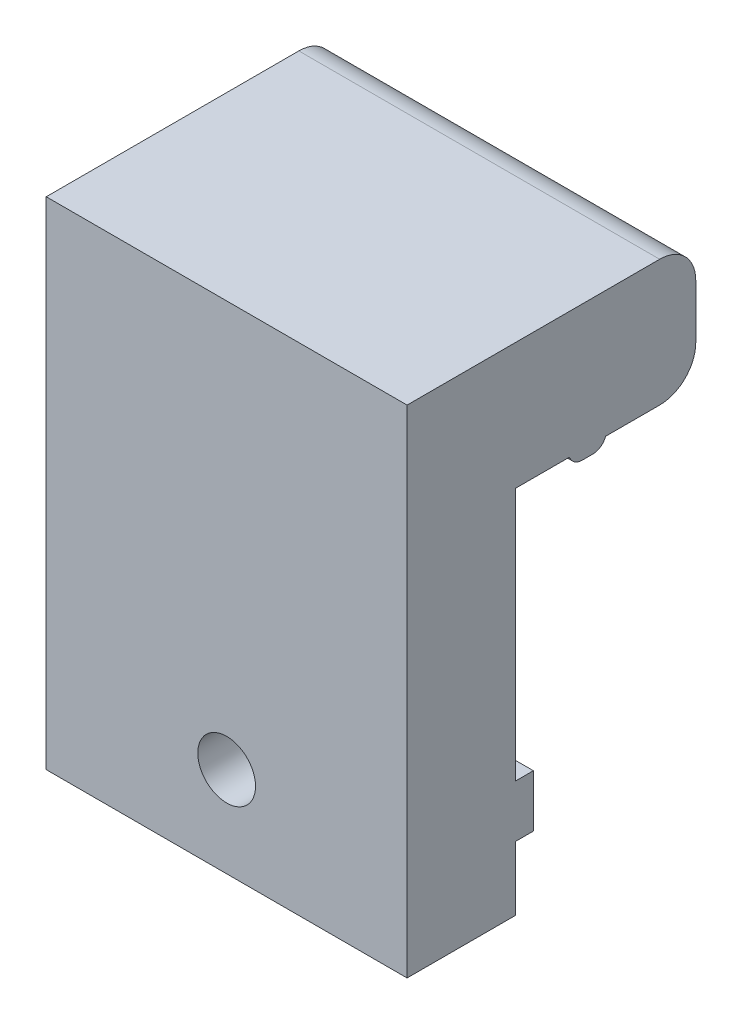
ISO-10303-21;
HEADER;
FILE_DESCRIPTION(('STEP AP214'),'2;1');
FILE_NAME('part.step','',(''),(''),'','','');
FILE_SCHEMA(('AUTOMOTIVE_DESIGN { 1 0 10303 214 1 1 1 1 }'));
ENDSEC;
DATA;
#1=APPLICATION_CONTEXT('core data for automotive mechanical design processes');
#2=APPLICATION_PROTOCOL_DEFINITION('international standard','automotive_design',2000,#1);
#3=PRODUCT_CONTEXT('',#1,'mechanical');
#4=PRODUCT('Part','Part','',(#3));
#5=PRODUCT_RELATED_PRODUCT_CATEGORY('part','',(#4));
#6=PRODUCT_DEFINITION_FORMATION('','',#4);
#7=PRODUCT_DEFINITION_CONTEXT('part definition',#1,'design');
#8=PRODUCT_DEFINITION('design','',#6,#7);
#9=PRODUCT_DEFINITION_SHAPE('','',#8);
#10=(LENGTH_UNIT() NAMED_UNIT(*) SI_UNIT(.MILLI.,.METRE.));
#11=(NAMED_UNIT(*) PLANE_ANGLE_UNIT() SI_UNIT($,.RADIAN.));
#12=(NAMED_UNIT(*) SI_UNIT($,.STERADIAN.) SOLID_ANGLE_UNIT());
#13=UNCERTAINTY_MEASURE_WITH_UNIT(LENGTH_MEASURE(1.E-05),#10,'distance_accuracy_value','');
#14=(GEOMETRIC_REPRESENTATION_CONTEXT(3) GLOBAL_UNCERTAINTY_ASSIGNED_CONTEXT((#13)) GLOBAL_UNIT_ASSIGNED_CONTEXT((#10,
#11,#12)) REPRESENTATION_CONTEXT('',''));
#15=CARTESIAN_POINT('',(0.,0.,0.));
#16=DIRECTION('',(0.,0.,1.));
#17=DIRECTION('',(1.,0.,0.));
#18=AXIS2_PLACEMENT_3D('',#15,#16,#17);
#19=CARTESIAN_POINT('',(10.,6.75,-10.));
#20=DIRECTION('',(0.,1.,0.));
#21=DIRECTION('',(0.,0.,1.));
#22=AXIS2_PLACEMENT_3D('',#19,#20,#21);
#23=PLANE('',#22);
#24=DIRECTION('',(-1.,0.,0.));
#25=VECTOR('',#24,1.);
#26=CARTESIAN_POINT('',(10.,6.75,-3.));
#27=LINE('',#26,#25);
#28=CARTESIAN_POINT('',(10.,6.75,-3.));
#29=VERTEX_POINT('',#28);
#30=CARTESIAN_POINT('',(-10.,6.75,-3.00000000000001));
#31=VERTEX_POINT('',#30);
#32=EDGE_CURVE('E193',#29,#31,#27,.T.);
#33=ORIENTED_EDGE('',*,*,#32,.F.);
#34=DIRECTION('',(0.,0.,1.));
#35=VECTOR('',#34,1.);
#36=CARTESIAN_POINT('',(10.,6.75,-10.));
#37=LINE('',#36,#35);
#38=CARTESIAN_POINT('',(10.,6.75,0.));
#39=VERTEX_POINT('',#38);
#40=EDGE_CURVE('E191',#29,#39,#37,.T.);
#41=ORIENTED_EDGE('',*,*,#40,.T.);
#42=DIRECTION('',(-1.,0.,0.));
#43=VECTOR('',#42,1.);
#44=CARTESIAN_POINT('',(10.,6.75,0.));
#45=LINE('',#44,#43);
#46=CARTESIAN_POINT('',(-10.,6.75,0.));
#47=VERTEX_POINT('',#46);
#48=EDGE_CURVE('E252',#39,#47,#45,.T.);
#49=ORIENTED_EDGE('',*,*,#48,.T.);
#50=DIRECTION('',(0.,0.,1.));
#51=VECTOR('',#50,1.);
#52=CARTESIAN_POINT('',(-10.,6.75,-10.));
#53=LINE('',#52,#51);
#54=EDGE_CURVE('E259',#31,#47,#53,.T.);
#55=ORIENTED_EDGE('',*,*,#54,.F.);
#56=EDGE_LOOP('',(#33,#41,#49,#55));
#57=FACE_BOUND('',#56,.T.);
#58=ADVANCED_FACE('F34',(#57),#23,.F.);
#59=DIRECTION('',(1.,0.,0.));
#60=VECTOR('',#59,1.);
#61=CARTESIAN_POINT('',(10.,6.75,-5.));
#62=LINE('',#61,#60);
#63=CARTESIAN_POINT('',(-10.,6.75,-5.));
#64=VERTEX_POINT('',#63);
#65=CARTESIAN_POINT('',(10.,6.75,-5.));
#66=VERTEX_POINT('',#65);
#67=EDGE_CURVE('E187',#64,#66,#62,.T.);
#68=ORIENTED_EDGE('',*,*,#67,.F.);
#69=CARTESIAN_POINT('',(-10.,6.75,-8.));
#70=VERTEX_POINT('',#69);
#71=EDGE_CURVE('E262',#70,#64,#53,.T.);
#72=ORIENTED_EDGE('',*,*,#71,.F.);
#73=DIRECTION('',(-1.,0.,0.));
#74=VECTOR('',#73,1.);
#75=CARTESIAN_POINT('',(10.,6.75,-8.));
#76=LINE('',#75,#74);
#77=CARTESIAN_POINT('',(10.,6.75,-8.));
#78=VERTEX_POINT('',#77);
#79=EDGE_CURVE('E189',#70,#78,#76,.F.);
#80=ORIENTED_EDGE('',*,*,#79,.T.);
#81=EDGE_CURVE('E176',#78,#66,#37,.T.);
#82=ORIENTED_EDGE('',*,*,#81,.T.);
#83=EDGE_LOOP('',(#68,#72,#80,#82));
#84=FACE_BOUND('',#83,.T.);
#85=ADVANCED_FACE('F185',(#84),#23,.F.);
#86=CARTESIAN_POINT('',(10.,-10.2,-1.));
#87=DIRECTION('',(0.,1.,0.));
#88=DIRECTION('',(0.,0.,1.));
#89=AXIS2_PLACEMENT_3D('',#86,#87,#88);
#90=PLANE('',#89);
#91=DIRECTION('',(-1.,0.,0.));
#92=VECTOR('',#91,1.);
#93=CARTESIAN_POINT('',(10.,-10.2,-1.));
#94=LINE('',#93,#92);
#95=CARTESIAN_POINT('',(-0.676387462923435,-10.2,-1.));
#96=VERTEX_POINT('',#95);
#97=CARTESIAN_POINT('',(-10.,-10.2,-1.));
#98=VERTEX_POINT('',#97);
#99=EDGE_CURVE('E225',#96,#98,#94,.T.);
#100=ORIENTED_EDGE('',*,*,#99,.F.);
#101=DIRECTION('',(0.,0.,1.));
#102=VECTOR('',#101,1.);
#103=CARTESIAN_POINT('',(-0.676387462923435,-10.2,-10.));
#104=LINE('',#103,#102);
#105=CARTESIAN_POINT('',(-0.676387462923435,-10.2,0.));
#106=VERTEX_POINT('',#105);
#107=EDGE_CURVE('E218',#96,#106,#104,.T.);
#108=ORIENTED_EDGE('',*,*,#107,.T.);
#109=DIRECTION('',(-1.,0.,0.));
#110=VECTOR('',#109,1.);
#111=CARTESIAN_POINT('',(10.,-10.2,0.));
#112=LINE('',#111,#110);
#113=CARTESIAN_POINT('',(-10.,-10.2,0.));
#114=VERTEX_POINT('',#113);
#115=EDGE_CURVE('E221',#106,#114,#112,.T.);
#116=ORIENTED_EDGE('',*,*,#115,.T.);
#117=DIRECTION('',(0.,0.,1.));
#118=VECTOR('',#117,1.);
#119=CARTESIAN_POINT('',(-10.,-10.2,-1.));
#120=LINE('',#119,#118);
#121=EDGE_CURVE('E247',#98,#114,#120,.T.);
#122=ORIENTED_EDGE('',*,*,#121,.F.);
#123=EDGE_LOOP('',(#100,#108,#116,#122));
#124=FACE_BOUND('',#123,.T.);
#125=ADVANCED_FACE('F345',(#124),#90,.F.);
#126=CARTESIAN_POINT('',(10.,-7.3,-1.));
#127=DIRECTION('',(0.,-1.,0.));
#128=DIRECTION('',(1.,0.,0.));
#129=AXIS2_PLACEMENT_3D('',#126,#127,#128);
#130=PLANE('',#129);
#131=DIRECTION('',(1.,0.,0.));
#132=VECTOR('',#131,1.);
#133=CARTESIAN_POINT('',(10.,-7.3,-1.));
#134=LINE('',#133,#132);
#135=CARTESIAN_POINT('',(0.676387462923428,-7.3,-0.999999999999999));
#136=VERTEX_POINT('',#135);
#137=CARTESIAN_POINT('',(10.,-7.3,-1.));
#138=VERTEX_POINT('',#137);
#139=EDGE_CURVE('E232',#136,#138,#134,.T.);
#140=ORIENTED_EDGE('',*,*,#139,.F.);
#141=DIRECTION('',(0.,0.,1.));
#142=VECTOR('',#141,1.);
#143=CARTESIAN_POINT('',(0.676387462923428,-7.3,-10.));
#144=LINE('',#143,#142);
#145=CARTESIAN_POINT('',(0.676387462923428,-7.3,0.));
#146=VERTEX_POINT('',#145);
#147=EDGE_CURVE('E203',#136,#146,#144,.T.);
#148=ORIENTED_EDGE('',*,*,#147,.T.);
#149=DIRECTION('',(1.,0.,0.));
#150=VECTOR('',#149,1.);
#151=CARTESIAN_POINT('',(10.,-7.3,0.));
#152=LINE('',#151,#150);
#153=CARTESIAN_POINT('',(10.,-7.29999999999999,0.));
#154=VERTEX_POINT('',#153);
#155=EDGE_CURVE('E240',#146,#154,#152,.T.);
#156=ORIENTED_EDGE('',*,*,#155,.T.);
#157=DIRECTION('',(0.,0.,1.));
#158=VECTOR('',#157,1.);
#159=CARTESIAN_POINT('',(10.,-7.3,-1.));
#160=LINE('',#159,#158);
#161=EDGE_CURVE('E236',#138,#154,#160,.T.);
#162=ORIENTED_EDGE('',*,*,#161,.F.);
#163=EDGE_LOOP('',(#140,#148,#156,#162));
#164=FACE_BOUND('',#163,.T.);
#165=ADVANCED_FACE('F412',(#164),#130,.F.);
#166=CARTESIAN_POINT('',(0.,0.,-1.));
#167=DIRECTION('',(0.,0.,1.));
#168=DIRECTION('',(1.,0.,0.));
#169=AXIS2_PLACEMENT_3D('',#166,#167,#168);
#170=PLANE('',#169);
#171=CARTESIAN_POINT('',(-10.,-7.29999999999999,-1.));
#172=VERTEX_POINT('',#171);
#173=CARTESIAN_POINT('',(-0.676387462923427,-7.3,-1.));
#174=VERTEX_POINT('',#173);
#175=EDGE_CURVE('E233',#172,#174,#134,.T.);
#176=ORIENTED_EDGE('',*,*,#175,.T.);
#177=CARTESIAN_POINT('',(0.,-8.75,-0.999999999999999));
#178=DIRECTION('',(0.,0.,1.));
#179=DIRECTION('',(1.,0.,0.));
#180=AXIS2_PLACEMENT_3D('',#177,#178,#179);
#181=CIRCLE('',#180,1.6);
#182=EDGE_CURVE('E314',#174,#96,#181,.T.);
#183=ORIENTED_EDGE('',*,*,#182,.T.);
#184=ORIENTED_EDGE('',*,*,#99,.T.);
#185=DIRECTION('',(0.,1.,0.));
#186=VECTOR('',#185,1.);
#187=CARTESIAN_POINT('',(-10.,-10.2,-1.));
#188=LINE('',#187,#186);
#189=EDGE_CURVE('E230',#98,#172,#188,.T.);
#190=ORIENTED_EDGE('',*,*,#189,.T.);
#191=EDGE_LOOP('',(#176,#183,#184,#190));
#192=FACE_BOUND('',#191,.T.);
#193=ADVANCED_FACE('F359',(#192),#170,.F.);
#194=CARTESIAN_POINT('',(0.,0.,0.));
#195=DIRECTION('',(0.,0.,1.));
#196=DIRECTION('',(1.,0.,0.));
#197=AXIS2_PLACEMENT_3D('',#194,#195,#196);
#198=PLANE('',#197);
#199=ORIENTED_EDGE('',*,*,#115,.F.);
#200=CARTESIAN_POINT('',(0.,-8.75,0.));
#201=DIRECTION('',(0.,0.,1.));
#202=DIRECTION('',(1.,0.,0.));
#203=AXIS2_PLACEMENT_3D('',#200,#201,#202);
#204=CIRCLE('',#203,1.6);
#205=CARTESIAN_POINT('',(0.676387462923435,-10.2,0.));
#206=VERTEX_POINT('',#205);
#207=EDGE_CURVE('E212',#106,#206,#204,.T.);
#208=ORIENTED_EDGE('',*,*,#207,.T.);
#209=CARTESIAN_POINT('',(10.,-10.2,0.));
#210=VERTEX_POINT('',#209);
#211=EDGE_CURVE('E237',#210,#206,#112,.T.);
#212=ORIENTED_EDGE('',*,*,#211,.F.);
#213=DIRECTION('',(0.,1.,0.));
#214=VECTOR('',#213,1.);
#215=CARTESIAN_POINT('',(10.,-13.75,0.));
#216=LINE('',#215,#214);
#217=CARTESIAN_POINT('',(10.,-13.75,0.));
#218=VERTEX_POINT('',#217);
#219=EDGE_CURVE('E268',#218,#210,#216,.T.);
#220=ORIENTED_EDGE('',*,*,#219,.F.);
#221=DIRECTION('',(1.,0.,0.));
#222=VECTOR('',#221,1.);
#223=CARTESIAN_POINT('',(-10.,-13.75,0.));
#224=LINE('',#223,#222);
#225=CARTESIAN_POINT('',(-10.,-13.75,0.));
#226=VERTEX_POINT('',#225);
#227=EDGE_CURVE('E278',#226,#218,#224,.T.);
#228=ORIENTED_EDGE('',*,*,#227,.F.);
#229=DIRECTION('',(0.,-1.,0.));
#230=VECTOR('',#229,1.);
#231=CARTESIAN_POINT('',(-10.,13.75,0.));
#232=LINE('',#231,#230);
#233=EDGE_CURVE('E190',#114,#226,#232,.T.);
#234=ORIENTED_EDGE('',*,*,#233,.F.);
#235=EDGE_LOOP('',(#199,#208,#212,#220,#228,#234));
#236=FACE_BOUND('',#235,.T.);
#237=ADVANCED_FACE('F355',(#236),#198,.F.);
#238=ORIENTED_EDGE('',*,*,#155,.F.);
#239=CARTESIAN_POINT('',(0.,-8.75,0.));
#240=DIRECTION('',(0.,0.,1.));
#241=DIRECTION('',(1.,0.,0.));
#242=AXIS2_PLACEMENT_3D('',#239,#240,#241);
#243=CIRCLE('',#242,1.6);
#244=CARTESIAN_POINT('',(-0.676387462923427,-7.3,0.));
#245=VERTEX_POINT('',#244);
#246=EDGE_CURVE('E209',#146,#245,#243,.T.);
#247=ORIENTED_EDGE('',*,*,#246,.T.);
#248=CARTESIAN_POINT('',(-10.,-7.29999999999999,0.));
#249=VERTEX_POINT('',#248);
#250=EDGE_CURVE('E226',#249,#245,#152,.T.);
#251=ORIENTED_EDGE('',*,*,#250,.F.);
#252=EDGE_CURVE('E275',#47,#249,#232,.T.);
#253=ORIENTED_EDGE('',*,*,#252,.F.);
#254=ORIENTED_EDGE('',*,*,#48,.F.);
#255=EDGE_CURVE('E280',#154,#39,#216,.T.);
#256=ORIENTED_EDGE('',*,*,#255,.F.);
#257=EDGE_LOOP('',(#238,#247,#251,#253,#254,#256));
#258=FACE_BOUND('',#257,.T.);
#259=ADVANCED_FACE('F358',(#258),#198,.F.);
#260=CARTESIAN_POINT('',(-10.,13.75,6.));
#261=DIRECTION('',(1.,0.,0.));
#262=DIRECTION('',(0.,0.,-1.));
#263=AXIS2_PLACEMENT_3D('',#260,#261,#262);
#264=PLANE('',#263);
#265=DIRECTION('',(0.,0.,-1.));
#266=VECTOR('',#265,1.);
#267=CARTESIAN_POINT('',(-10.,6.25,-3.00000000000001));
#268=LINE('',#267,#266);
#269=CARTESIAN_POINT('',(-10.,6.25,-3.70710678118656));
#270=VERTEX_POINT('',#269);
#271=CARTESIAN_POINT('',(-10.,6.25,-4.29289321881345));
#272=VERTEX_POINT('',#271);
#273=EDGE_CURVE('E195',#270,#272,#268,.T.);
#274=ORIENTED_EDGE('',*,*,#273,.F.);
#275=CARTESIAN_POINT('',(-10.,7.,-3.70710678118656));
#276=DIRECTION('',(1.,0.,0.));
#277=DIRECTION('',(0.,0.,-1.));
#278=AXIS2_PLACEMENT_3D('',#275,#276,#277);
#279=CIRCLE('',#278,0.75);
#280=EDGE_CURVE('E57',#270,#31,#279,.F.);
#281=ORIENTED_EDGE('',*,*,#280,.T.);
#282=ORIENTED_EDGE('',*,*,#54,.T.);
#283=ORIENTED_EDGE('',*,*,#252,.T.);
#284=DIRECTION('',(0.,0.,1.));
#285=VECTOR('',#284,1.);
#286=CARTESIAN_POINT('',(-10.,-7.29999999999999,-1.));
#287=LINE('',#286,#285);
#288=EDGE_CURVE('E245',#172,#249,#287,.T.);
#289=ORIENTED_EDGE('',*,*,#288,.F.);
#290=ORIENTED_EDGE('',*,*,#189,.F.);
#291=ORIENTED_EDGE('',*,*,#121,.T.);
#292=ORIENTED_EDGE('',*,*,#233,.T.);
#293=DIRECTION('',(0.,0.,-1.));
#294=VECTOR('',#293,1.);
#295=CARTESIAN_POINT('',(-10.,-13.75,6.));
#296=LINE('',#295,#294);
#297=CARTESIAN_POINT('',(-10.,-13.75,6.));
#298=VERTEX_POINT('',#297);
#299=EDGE_CURVE('E291',#298,#226,#296,.T.);
#300=ORIENTED_EDGE('',*,*,#299,.F.);
#301=DIRECTION('',(0.,-1.,0.));
#302=VECTOR('',#301,1.);
#303=CARTESIAN_POINT('',(-10.,13.75,6.));
#304=LINE('',#303,#302);
#305=CARTESIAN_POINT('',(-10.,13.75,6.));
#306=VERTEX_POINT('',#305);
#307=EDGE_CURVE('E264',#306,#298,#304,.T.);
#308=ORIENTED_EDGE('',*,*,#307,.F.);
#309=DIRECTION('',(0.,0.,-1.));
#310=VECTOR('',#309,1.);
#311=CARTESIAN_POINT('',(-10.,13.75,6.));
#312=LINE('',#311,#310);
#313=CARTESIAN_POINT('',(-10.,13.75,-8.));
#314=VERTEX_POINT('',#313);
#315=EDGE_CURVE('E274',#306,#314,#312,.T.);
#316=ORIENTED_EDGE('',*,*,#315,.T.);
#317=CARTESIAN_POINT('',(-10.,11.75,-8.));
#318=DIRECTION('',(1.,0.,0.));
#319=DIRECTION('',(0.,0.,-1.));
#320=AXIS2_PLACEMENT_3D('',#317,#318,#319);
#321=CIRCLE('',#320,2.);
#322=CARTESIAN_POINT('',(-10.,11.75,-10.));
#323=VERTEX_POINT('',#322);
#324=EDGE_CURVE('E308',#314,#323,#321,.F.);
#325=ORIENTED_EDGE('',*,*,#324,.T.);
#326=DIRECTION('',(0.,1.,0.));
#327=VECTOR('',#326,1.);
#328=CARTESIAN_POINT('',(-10.,13.75,-10.));
#329=LINE('',#328,#327);
#330=CARTESIAN_POINT('',(-10.,8.75,-10.));
#331=VERTEX_POINT('',#330);
#332=EDGE_CURVE('E256',#331,#323,#329,.T.);
#333=ORIENTED_EDGE('',*,*,#332,.F.);
#334=CARTESIAN_POINT('',(-10.,8.75,-8.));
#335=DIRECTION('',(1.,0.,0.));
#336=DIRECTION('',(0.,0.,-1.));
#337=AXIS2_PLACEMENT_3D('',#334,#335,#336);
#338=CIRCLE('',#337,2.);
#339=EDGE_CURVE('E306',#331,#70,#338,.F.);
#340=ORIENTED_EDGE('',*,*,#339,.T.);
#341=ORIENTED_EDGE('',*,*,#71,.T.);
#342=CARTESIAN_POINT('',(-10.,7.,-4.29289321881345));
#343=DIRECTION('',(1.,0.,0.));
#344=DIRECTION('',(0.,0.,-1.));
#345=AXIS2_PLACEMENT_3D('',#342,#343,#344);
#346=CIRCLE('',#345,0.75);
#347=EDGE_CURVE('E49',#64,#272,#346,.F.);
#348=ORIENTED_EDGE('',*,*,#347,.T.);
#349=EDGE_LOOP('',(#274,#281,#282,#283,#289,#290,#291,#292,#300,#308,#316,#325,#333,#340,#341,#348));
#350=FACE_BOUND('',#349,.T.);
#351=ADVANCED_FACE('F321',(#350),#264,.F.);
#352=CARTESIAN_POINT('',(-10.,-13.75,6.));
#353=DIRECTION('',(0.,1.,0.));
#354=DIRECTION('',(0.,0.,1.));
#355=AXIS2_PLACEMENT_3D('',#352,#353,#354);
#356=PLANE('',#355);
#357=ORIENTED_EDGE('',*,*,#227,.T.);
#358=DIRECTION('',(0.,0.,-1.));
#359=VECTOR('',#358,1.);
#360=CARTESIAN_POINT('',(10.,-13.75,6.));
#361=LINE('',#360,#359);
#362=CARTESIAN_POINT('',(10.,-13.75,6.));
#363=VERTEX_POINT('',#362);
#364=EDGE_CURVE('E288',#363,#218,#361,.T.);
#365=ORIENTED_EDGE('',*,*,#364,.F.);
#366=DIRECTION('',(1.,0.,0.));
#367=VECTOR('',#366,1.);
#368=CARTESIAN_POINT('',(-10.,-13.75,6.));
#369=LINE('',#368,#367);
#370=EDGE_CURVE('E267',#298,#363,#369,.T.);
#371=ORIENTED_EDGE('',*,*,#370,.F.);
#372=ORIENTED_EDGE('',*,*,#299,.T.);
#373=EDGE_LOOP('',(#357,#365,#371,#372));
#374=FACE_BOUND('',#373,.T.);
#375=ADVANCED_FACE('F366',(#374),#356,.F.);
#376=CARTESIAN_POINT('',(10.,-13.75,6.));
#377=DIRECTION('',(-1.,0.,0.));
#378=DIRECTION('',(0.,0.,1.));
#379=AXIS2_PLACEMENT_3D('',#376,#377,#378);
#380=PLANE('',#379);
#381=ORIENTED_EDGE('',*,*,#40,.F.);
#382=CARTESIAN_POINT('',(10.,7.,-3.70710678118655));
#383=DIRECTION('',(-1.,0.,0.));
#384=DIRECTION('',(0.,0.,1.));
#385=AXIS2_PLACEMENT_3D('',#382,#383,#384);
#386=CIRCLE('',#385,0.75);
#387=CARTESIAN_POINT('',(10.,6.25,-3.70710678118655));
#388=VERTEX_POINT('',#387);
#389=EDGE_CURVE('E11',#29,#388,#386,.F.);
#390=ORIENTED_EDGE('',*,*,#389,.T.);
#391=DIRECTION('',(0.,0.,1.));
#392=VECTOR('',#391,1.);
#393=CARTESIAN_POINT('',(10.,6.25,-3.));
#394=LINE('',#393,#392);
#395=CARTESIAN_POINT('',(10.,6.25,-4.29289321881345));
#396=VERTEX_POINT('',#395);
#397=EDGE_CURVE('E179',#396,#388,#394,.T.);
#398=ORIENTED_EDGE('',*,*,#397,.F.);
#399=CARTESIAN_POINT('',(10.,7.,-4.29289321881345));
#400=DIRECTION('',(-1.,0.,0.));
#401=DIRECTION('',(0.,0.,1.));
#402=AXIS2_PLACEMENT_3D('',#399,#400,#401);
#403=CIRCLE('',#402,0.75);
#404=EDGE_CURVE('E42',#396,#66,#403,.F.);
#405=ORIENTED_EDGE('',*,*,#404,.T.);
#406=ORIENTED_EDGE('',*,*,#81,.F.);
#407=CARTESIAN_POINT('',(10.,8.75,-8.));
#408=DIRECTION('',(-1.,0.,0.));
#409=DIRECTION('',(0.,0.,1.));
#410=AXIS2_PLACEMENT_3D('',#407,#408,#409);
#411=CIRCLE('',#410,2.);
#412=CARTESIAN_POINT('',(10.,8.75,-10.));
#413=VERTEX_POINT('',#412);
#414=EDGE_CURVE('E300',#78,#413,#411,.F.);
#415=ORIENTED_EDGE('',*,*,#414,.T.);
#416=DIRECTION('',(0.,-1.,0.));
#417=VECTOR('',#416,1.);
#418=CARTESIAN_POINT('',(10.,13.75,-10.));
#419=LINE('',#418,#417);
#420=CARTESIAN_POINT('',(10.,11.75,-10.));
#421=VERTEX_POINT('',#420);
#422=EDGE_CURVE('E253',#421,#413,#419,.T.);
#423=ORIENTED_EDGE('',*,*,#422,.F.);
#424=CARTESIAN_POINT('',(10.,11.75,-8.));
#425=DIRECTION('',(-1.,0.,0.));
#426=DIRECTION('',(0.,0.,1.));
#427=AXIS2_PLACEMENT_3D('',#424,#425,#426);
#428=CIRCLE('',#427,2.);
#429=CARTESIAN_POINT('',(10.,13.75,-8.));
#430=VERTEX_POINT('',#429);
#431=EDGE_CURVE('E302',#421,#430,#428,.F.);
#432=ORIENTED_EDGE('',*,*,#431,.T.);
#433=DIRECTION('',(0.,0.,-1.));
#434=VECTOR('',#433,1.);
#435=CARTESIAN_POINT('',(10.,13.75,6.));
#436=LINE('',#435,#434);
#437=CARTESIAN_POINT('',(10.,13.75,6.));
#438=VERTEX_POINT('',#437);
#439=EDGE_CURVE('E285',#438,#430,#436,.T.);
#440=ORIENTED_EDGE('',*,*,#439,.F.);
#441=DIRECTION('',(0.,1.,0.));
#442=VECTOR('',#441,1.);
#443=CARTESIAN_POINT('',(10.,-13.75,6.));
#444=LINE('',#443,#442);
#445=EDGE_CURVE('E270',#363,#438,#444,.T.);
#446=ORIENTED_EDGE('',*,*,#445,.F.);
#447=ORIENTED_EDGE('',*,*,#364,.T.);
#448=ORIENTED_EDGE('',*,*,#219,.T.);
#449=DIRECTION('',(0.,0.,1.));
#450=VECTOR('',#449,1.);
#451=CARTESIAN_POINT('',(10.,-10.2,-1.));
#452=LINE('',#451,#450);
#453=CARTESIAN_POINT('',(10.,-10.2,-1.));
#454=VERTEX_POINT('',#453);
#455=EDGE_CURVE('E250',#454,#210,#452,.T.);
#456=ORIENTED_EDGE('',*,*,#455,.F.);
#457=DIRECTION('',(0.,-1.,0.));
#458=VECTOR('',#457,1.);
#459=CARTESIAN_POINT('',(10.,-10.2,-1.));
#460=LINE('',#459,#458);
#461=EDGE_CURVE('E222',#138,#454,#460,.T.);
#462=ORIENTED_EDGE('',*,*,#461,.F.);
#463=ORIENTED_EDGE('',*,*,#161,.T.);
#464=ORIENTED_EDGE('',*,*,#255,.T.);
#465=EDGE_LOOP('',(#381,#390,#398,#405,#406,#415,#423,#432,#440,#446,#447,#448,#456,#462,#463,#464));
#466=FACE_BOUND('',#465,.T.);
#467=ADVANCED_FACE('F175',(#466),#380,.F.);
#468=CARTESIAN_POINT('',(10.,13.75,6.));
#469=DIRECTION('',(0.,-1.,0.));
#470=DIRECTION('',(0.,0.,-1.));
#471=AXIS2_PLACEMENT_3D('',#468,#469,#470);
#472=PLANE('',#471);
#473=ORIENTED_EDGE('',*,*,#439,.T.);
#474=DIRECTION('',(1.,0.,0.));
#475=VECTOR('',#474,1.);
#476=CARTESIAN_POINT('',(-10.,13.75,-8.));
#477=LINE('',#476,#475);
#478=EDGE_CURVE('E304',#430,#314,#477,.F.);
#479=ORIENTED_EDGE('',*,*,#478,.T.);
#480=ORIENTED_EDGE('',*,*,#315,.F.);
#481=DIRECTION('',(-1.,0.,0.));
#482=VECTOR('',#481,1.);
#483=CARTESIAN_POINT('',(10.,13.75,6.));
#484=LINE('',#483,#482);
#485=EDGE_CURVE('E272',#438,#306,#484,.T.);
#486=ORIENTED_EDGE('',*,*,#485,.F.);
#487=EDGE_LOOP('',(#473,#479,#480,#486));
#488=FACE_BOUND('',#487,.T.);
#489=ADVANCED_FACE('F353',(#488),#472,.F.);
#490=CARTESIAN_POINT('',(0.,0.,6.));
#491=DIRECTION('',(0.,0.,1.));
#492=DIRECTION('',(1.,0.,0.));
#493=AXIS2_PLACEMENT_3D('',#490,#491,#492);
#494=PLANE('',#493);
#495=CARTESIAN_POINT('',(0.,-8.75,6.));
#496=DIRECTION('',(0.,0.,1.));
#497=DIRECTION('',(1.,0.,0.));
#498=AXIS2_PLACEMENT_3D('',#495,#496,#497);
#499=CIRCLE('',#498,1.6);
#500=CARTESIAN_POINT('',(1.6,-8.75,6.));
#501=VERTEX_POINT('',#500);
#502=EDGE_CURVE('E200',#501,#501,#499,.T.);
#503=ORIENTED_EDGE('',*,*,#502,.F.);
#504=EDGE_LOOP('',(#503));
#505=FACE_BOUND('',#504,.T.);
#506=ORIENTED_EDGE('',*,*,#307,.T.);
#507=ORIENTED_EDGE('',*,*,#370,.T.);
#508=ORIENTED_EDGE('',*,*,#445,.T.);
#509=ORIENTED_EDGE('',*,*,#485,.T.);
#510=EDGE_LOOP('',(#506,#507,#508,#509));
#511=FACE_BOUND('',#510,.T.);
#512=ADVANCED_FACE('F350',(#505,#511),#494,.T.);
#513=CARTESIAN_POINT('',(0.,0.,-10.));
#514=DIRECTION('',(0.,0.,-1.));
#515=DIRECTION('',(-1.,0.,0.));
#516=AXIS2_PLACEMENT_3D('',#513,#514,#515);
#517=PLANE('',#516);
#518=ORIENTED_EDGE('',*,*,#332,.T.);
#519=DIRECTION('',(1.,0.,0.));
#520=VECTOR('',#519,1.);
#521=CARTESIAN_POINT('',(10.,11.75,-10.));
#522=LINE('',#521,#520);
#523=EDGE_CURVE('E297',#323,#421,#522,.T.);
#524=ORIENTED_EDGE('',*,*,#523,.T.);
#525=ORIENTED_EDGE('',*,*,#422,.T.);
#526=DIRECTION('',(-1.,0.,0.));
#527=VECTOR('',#526,1.);
#528=CARTESIAN_POINT('',(-10.,8.75,-10.));
#529=LINE('',#528,#527);
#530=EDGE_CURVE('E294',#413,#331,#529,.T.);
#531=ORIENTED_EDGE('',*,*,#530,.T.);
#532=EDGE_LOOP('',(#518,#524,#525,#531));
#533=FACE_BOUND('',#532,.T.);
#534=ADVANCED_FACE('F348',(#533),#517,.T.);
#535=CARTESIAN_POINT('',(0.,11.75,-8.));
#536=DIRECTION('',(-1.,0.,0.));
#537=DIRECTION('',(0.,0.,1.));
#538=AXIS2_PLACEMENT_3D('',#535,#536,#537);
#539=CYLINDRICAL_SURFACE('',#538,2.);
#540=ORIENTED_EDGE('',*,*,#324,.F.);
#541=ORIENTED_EDGE('',*,*,#478,.F.);
#542=ORIENTED_EDGE('',*,*,#431,.F.);
#543=ORIENTED_EDGE('',*,*,#523,.F.);
#544=EDGE_LOOP('',(#540,#541,#542,#543));
#545=FACE_BOUND('',#544,.T.);
#546=ADVANCED_FACE('F372',(#545),#539,.T.);
#547=CARTESIAN_POINT('',(0.,8.75,-8.));
#548=DIRECTION('',(1.,0.,0.));
#549=DIRECTION('',(0.,0.,-1.));
#550=AXIS2_PLACEMENT_3D('',#547,#548,#549);
#551=CYLINDRICAL_SURFACE('',#550,2.);
#552=ORIENTED_EDGE('',*,*,#414,.F.);
#553=ORIENTED_EDGE('',*,*,#79,.F.);
#554=ORIENTED_EDGE('',*,*,#339,.F.);
#555=ORIENTED_EDGE('',*,*,#530,.F.);
#556=EDGE_LOOP('',(#552,#553,#554,#555));
#557=FACE_BOUND('',#556,.T.);
#558=ADVANCED_FACE('F375',(#557),#551,.T.);
#559=ORIENTED_EDGE('',*,*,#211,.T.);
#560=DIRECTION('',(0.,0.,1.));
#561=VECTOR('',#560,1.);
#562=CARTESIAN_POINT('',(0.676387462923435,-10.2,-10.));
#563=LINE('',#562,#561);
#564=CARTESIAN_POINT('',(0.676387462923435,-10.2,-0.999999999999999));
#565=VERTEX_POINT('',#564);
#566=EDGE_CURVE('E206',#206,#565,#563,.F.);
#567=ORIENTED_EDGE('',*,*,#566,.T.);
#568=EDGE_CURVE('E227',#454,#565,#94,.T.);
#569=ORIENTED_EDGE('',*,*,#568,.F.);
#570=ORIENTED_EDGE('',*,*,#455,.T.);
#571=EDGE_LOOP('',(#559,#567,#569,#570));
#572=FACE_BOUND('',#571,.T.);
#573=ADVANCED_FACE('F378',(#572),#90,.F.);
#574=ORIENTED_EDGE('',*,*,#250,.T.);
#575=DIRECTION('',(0.,0.,1.));
#576=VECTOR('',#575,1.);
#577=CARTESIAN_POINT('',(-0.676387462923427,-7.3,-10.));
#578=LINE('',#577,#576);
#579=EDGE_CURVE('E215',#245,#174,#578,.F.);
#580=ORIENTED_EDGE('',*,*,#579,.T.);
#581=ORIENTED_EDGE('',*,*,#175,.F.);
#582=ORIENTED_EDGE('',*,*,#288,.T.);
#583=EDGE_LOOP('',(#574,#580,#581,#582));
#584=FACE_BOUND('',#583,.T.);
#585=ADVANCED_FACE('F383',(#584),#130,.F.);
#586=ORIENTED_EDGE('',*,*,#568,.T.);
#587=EDGE_CURVE('E311',#565,#136,#181,.T.);
#588=ORIENTED_EDGE('',*,*,#587,.T.);
#589=ORIENTED_EDGE('',*,*,#139,.T.);
#590=ORIENTED_EDGE('',*,*,#461,.T.);
#591=EDGE_LOOP('',(#586,#588,#589,#590));
#592=FACE_BOUND('',#591,.T.);
#593=ADVANCED_FACE('F337',(#592),#170,.F.);
#594=CARTESIAN_POINT('',(0.,-8.75,-10.));
#595=DIRECTION('',(0.,0.,1.));
#596=DIRECTION('',(1.,0.,0.));
#597=AXIS2_PLACEMENT_3D('',#594,#595,#596);
#598=CYLINDRICAL_SURFACE('',#597,1.6);
#599=ORIENTED_EDGE('',*,*,#502,.T.);
#600=EDGE_LOOP('',(#599));
#601=FACE_BOUND('',#600,.T.);
#602=ORIENTED_EDGE('',*,*,#579,.F.);
#603=ORIENTED_EDGE('',*,*,#246,.F.);
#604=ORIENTED_EDGE('',*,*,#147,.F.);
#605=ORIENTED_EDGE('',*,*,#587,.F.);
#606=ORIENTED_EDGE('',*,*,#566,.F.);
#607=ORIENTED_EDGE('',*,*,#207,.F.);
#608=ORIENTED_EDGE('',*,*,#107,.F.);
#609=ORIENTED_EDGE('',*,*,#182,.F.);
#610=EDGE_LOOP('',(#602,#603,#604,#605,#606,#607,#608,#609));
#611=FACE_BOUND('',#610,.T.);
#612=ADVANCED_FACE('F331',(#601,#611),#598,.F.);
#613=CARTESIAN_POINT('',(0.,6.25,0.));
#614=DIRECTION('',(0.,1.,0.));
#615=DIRECTION('',(0.,0.,1.));
#616=AXIS2_PLACEMENT_3D('',#613,#614,#615);
#617=PLANE('',#616);
#618=ORIENTED_EDGE('',*,*,#397,.T.);
#619=DIRECTION('',(1.,0.,0.));
#620=VECTOR('',#619,1.);
#621=CARTESIAN_POINT('',(0.,6.25,-3.70710678118655));
#622=LINE('',#621,#620);
#623=EDGE_CURVE('E317',#388,#270,#622,.F.);
#624=ORIENTED_EDGE('',*,*,#623,.T.);
#625=ORIENTED_EDGE('',*,*,#273,.T.);
#626=DIRECTION('',(-1.,0.,0.));
#627=VECTOR('',#626,1.);
#628=CARTESIAN_POINT('',(0.,6.25,-4.29289321881345));
#629=LINE('',#628,#627);
#630=EDGE_CURVE('E315',#272,#396,#629,.F.);
#631=ORIENTED_EDGE('',*,*,#630,.T.);
#632=EDGE_LOOP('',(#618,#624,#625,#631));
#633=FACE_BOUND('',#632,.T.);
#634=ADVANCED_FACE('F329',(#633),#617,.F.);
#635=CARTESIAN_POINT('',(10.,7.,-3.70710678118655));
#636=DIRECTION('',(1.,0.,0.));
#637=DIRECTION('',(0.,0.,-1.));
#638=AXIS2_PLACEMENT_3D('',#635,#636,#637);
#639=CYLINDRICAL_SURFACE('',#638,0.75);
#640=ORIENTED_EDGE('',*,*,#389,.F.);
#641=ORIENTED_EDGE('',*,*,#32,.T.);
#642=ORIENTED_EDGE('',*,*,#280,.F.);
#643=ORIENTED_EDGE('',*,*,#623,.F.);
#644=EDGE_LOOP('',(#640,#641,#642,#643));
#645=FACE_BOUND('',#644,.T.);
#646=ADVANCED_FACE('F326',(#645),#639,.T.);
#647=CARTESIAN_POINT('',(10.,7.,-4.29289321881345));
#648=DIRECTION('',(-1.,0.,0.));
#649=DIRECTION('',(0.,0.,1.));
#650=AXIS2_PLACEMENT_3D('',#647,#648,#649);
#651=CYLINDRICAL_SURFACE('',#650,0.75);
#652=ORIENTED_EDGE('',*,*,#347,.F.);
#653=ORIENTED_EDGE('',*,*,#67,.T.);
#654=ORIENTED_EDGE('',*,*,#404,.F.);
#655=ORIENTED_EDGE('',*,*,#630,.F.);
#656=EDGE_LOOP('',(#652,#653,#654,#655));
#657=FACE_BOUND('',#656,.T.);
#658=ADVANCED_FACE('F36',(#657),#651,.T.);
#659=CLOSED_SHELL('',(#58,#85,#125,#165,#193,#237,#259,#351,#375,#467,#489,#512,#534,#546,#558,
#573,#585,#593,#612,#634,#646,#658));
#660=MANIFOLD_SOLID_BREP('B2',#659);
#661=ADVANCED_BREP_SHAPE_REPRESENTATION('',(#18,#660),#14);
#662=SHAPE_DEFINITION_REPRESENTATION(#9,#661);
ENDSEC;
END-ISO-10303-21;
